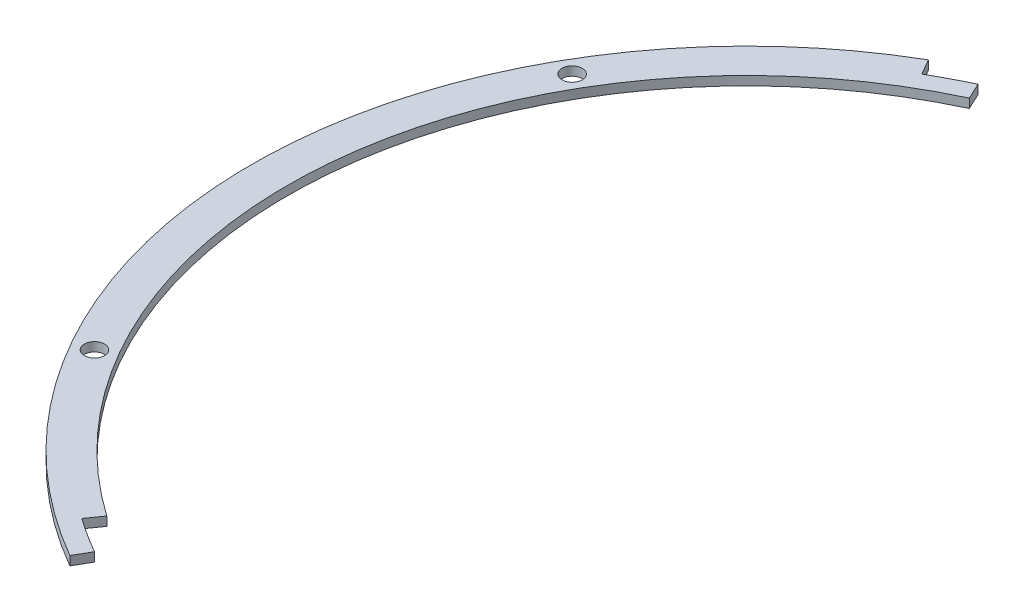
ISO-10303-21;
HEADER;
FILE_DESCRIPTION(('STEP AP214'),'2;1');
FILE_NAME('part.step','',(''),(''),'','','');
FILE_SCHEMA(('AUTOMOTIVE_DESIGN { 1 0 10303 214 1 1 1 1 }'));
ENDSEC;
DATA;
#1=APPLICATION_CONTEXT('core data for automotive mechanical design processes');
#2=APPLICATION_PROTOCOL_DEFINITION('international standard','automotive_design',2000,#1);
#3=PRODUCT_CONTEXT('',#1,'mechanical');
#4=PRODUCT('Part','Part','',(#3));
#5=PRODUCT_RELATED_PRODUCT_CATEGORY('part','',(#4));
#6=PRODUCT_DEFINITION_FORMATION('','',#4);
#7=PRODUCT_DEFINITION_CONTEXT('part definition',#1,'design');
#8=PRODUCT_DEFINITION('design','',#6,#7);
#9=PRODUCT_DEFINITION_SHAPE('','',#8);
#10=(LENGTH_UNIT() NAMED_UNIT(*) SI_UNIT(.MILLI.,.METRE.));
#11=(NAMED_UNIT(*) PLANE_ANGLE_UNIT() SI_UNIT($,.RADIAN.));
#12=(NAMED_UNIT(*) SI_UNIT($,.STERADIAN.) SOLID_ANGLE_UNIT());
#13=UNCERTAINTY_MEASURE_WITH_UNIT(LENGTH_MEASURE(1.E-05),#10,'distance_accuracy_value','');
#14=(GEOMETRIC_REPRESENTATION_CONTEXT(3) GLOBAL_UNCERTAINTY_ASSIGNED_CONTEXT((#13)) GLOBAL_UNIT_ASSIGNED_CONTEXT((#10,
#11,#12)) REPRESENTATION_CONTEXT('',''));
#15=CARTESIAN_POINT('',(0.,0.,0.));
#16=DIRECTION('',(0.,0.,1.));
#17=DIRECTION('',(1.,0.,0.));
#18=AXIS2_PLACEMENT_3D('',#15,#16,#17);
#19=CARTESIAN_POINT('',(0.,3.175,0.));
#20=DIRECTION('',(0.,1.,0.));
#21=DIRECTION('',(0.,0.,1.));
#22=AXIS2_PLACEMENT_3D('',#19,#20,#21);
#23=PLANE('',#22);
#24=CARTESIAN_POINT('',(-145.925280537664,3.175,84.2500000000083));
#25=DIRECTION('',(0.,1.,0.));
#26=DIRECTION('',(0.,0.,1.));
#27=AXIS2_PLACEMENT_3D('',#24,#25,#26);
#28=CIRCLE('',#27,3.55600000000001);
#29=CARTESIAN_POINT('',(-145.925280537664,3.175,87.8060000000084));
#30=VERTEX_POINT('',#29);
#31=EDGE_CURVE('E194',#30,#30,#28,.T.);
#32=ORIENTED_EDGE('',*,*,#31,.F.);
#33=EDGE_LOOP('',(#32));
#34=FACE_BOUND('',#33,.T.);
#35=CARTESIAN_POINT('',(-145.925280537673,3.175,-84.2499999999916));
#36=DIRECTION('',(0.,1.,0.));
#37=DIRECTION('',(0.,0.,1.));
#38=AXIS2_PLACEMENT_3D('',#35,#36,#37);
#39=CIRCLE('',#38,3.55600000000001);
#40=CARTESIAN_POINT('',(-145.925280537673,3.175,-80.6939999999916));
#41=VERTEX_POINT('',#40);
#42=EDGE_CURVE('E186',#41,#41,#39,.T.);
#43=ORIENTED_EDGE('',*,*,#42,.F.);
#44=EDGE_LOOP('',(#43));
#45=FACE_BOUND('',#44,.T.);
#46=CARTESIAN_POINT('',(0.,3.175,0.));
#47=DIRECTION('',(0.,-1.,0.));
#48=DIRECTION('',(0.,0.,1.));
#49=AXIS2_PLACEMENT_3D('',#46,#47,#48);
#50=CIRCLE('',#49,168.5);
#51=CARTESIAN_POINT('',(-84.2499999999999,3.175,-145.925280537678));
#52=VERTEX_POINT('',#51);
#53=CARTESIAN_POINT('',(-71.2111771033099,3.175,-152.712862115675));
#54=VERTEX_POINT('',#53);
#55=EDGE_CURVE('E120',#52,#54,#50,.T.);
#56=ORIENTED_EDGE('',*,*,#55,.F.);
#57=DIRECTION('',(0.499999999999998,0.,0.86602540378444));
#58=VECTOR('',#57,1.);
#59=CARTESIAN_POINT('',(-88.8999999999998,3.175,-153.979316792873));
#60=LINE('',#59,#58);
#61=CARTESIAN_POINT('',(-87.4249999999999,3.175,-151.424541851709));
#62=VERTEX_POINT('',#61);
#63=EDGE_CURVE('E109',#62,#52,#60,.T.);
#64=ORIENTED_EDGE('',*,*,#63,.F.);
#65=CARTESIAN_POINT('',(0.,3.175,0.));
#66=DIRECTION('',(0.,1.,0.));
#67=DIRECTION('',(0.,0.,1.));
#68=AXIS2_PLACEMENT_3D('',#65,#66,#67);
#69=CIRCLE('',#68,174.85);
#70=CARTESIAN_POINT('',(-87.4250000000005,3.175,151.424541851709));
#71=VERTEX_POINT('',#70);
#72=EDGE_CURVE('E202',#62,#71,#69,.T.);
#73=ORIENTED_EDGE('',*,*,#72,.T.);
#74=DIRECTION('',(-0.500000000000002,0.,0.866025403784437));
#75=VECTOR('',#74,1.);
#76=CARTESIAN_POINT('',(-84.2500000000005,3.175,145.925280537678));
#77=LINE('',#76,#75);
#78=CARTESIAN_POINT('',(-84.2500000000005,3.175,145.925280537678));
#79=VERTEX_POINT('',#78);
#80=EDGE_CURVE('E143',#79,#71,#77,.T.);
#81=ORIENTED_EDGE('',*,*,#80,.F.);
#82=CARTESIAN_POINT('',(0.,3.175,0.));
#83=DIRECTION('',(0.,1.,0.));
#84=DIRECTION('',(0.,0.,1.));
#85=AXIS2_PLACEMENT_3D('',#82,#83,#84);
#86=CIRCLE('',#85,168.5);
#87=CARTESIAN_POINT('',(-96.6476295251518,3.175,138.027119462695));
#88=VERTEX_POINT('',#87);
#89=EDGE_CURVE('E140',#88,#79,#86,.T.);
#90=ORIENTED_EDGE('',*,*,#89,.F.);
#91=DIRECTION('',(-0.573576436351051,0.,0.819152044288988));
#92=VECTOR('',#91,1.);
#93=CARTESIAN_POINT('',(-96.6476295251518,3.175,138.027119462695));
#94=LINE('',#93,#92);
#95=CARTESIAN_POINT('',(-93.0054191543226,3.175,132.82550398146));
#96=VERTEX_POINT('',#95);
#97=EDGE_CURVE('E135',#96,#88,#94,.T.);
#98=ORIENTED_EDGE('',*,*,#97,.F.);
#99=CARTESIAN_POINT('',(0.,3.175,0.));
#100=DIRECTION('',(0.,1.,0.));
#101=DIRECTION('',(0.,0.,1.));
#102=AXIS2_PLACEMENT_3D('',#99,#100,#101);
#103=CIRCLE('',#102,162.15);
#104=CARTESIAN_POINT('',(-68.5275511412553,3.175,-146.957807667992));
#105=VERTEX_POINT('',#104);
#106=EDGE_CURVE('E180',#105,#96,#103,.T.);
#107=ORIENTED_EDGE('',*,*,#106,.F.);
#108=DIRECTION('',(0.422618261740886,0.,0.906307787036563));
#109=VECTOR('',#108,1.);
#110=CARTESIAN_POINT('',(-71.2111771033099,3.175,-152.712862115675));
#111=LINE('',#110,#109);
#112=EDGE_CURVE('E66',#54,#105,#111,.T.);
#113=ORIENTED_EDGE('',*,*,#112,.F.);
#114=EDGE_LOOP('',(#56,#64,#73,#81,#90,#98,#107,#113));
#115=FACE_BOUND('',#114,.T.);
#116=ADVANCED_FACE('F42',(#34,#45,#115),#23,.T.);
#117=CARTESIAN_POINT('',(0.,0.,0.));
#118=DIRECTION('',(0.,1.,0.));
#119=DIRECTION('',(0.,0.,1.));
#120=AXIS2_PLACEMENT_3D('',#117,#118,#119);
#121=PLANE('',#120);
#122=CARTESIAN_POINT('',(-145.925280537673,0.,-84.2499999999916));
#123=DIRECTION('',(0.,1.,0.));
#124=DIRECTION('',(0.,0.,1.));
#125=AXIS2_PLACEMENT_3D('',#122,#123,#124);
#126=CIRCLE('',#125,3.55600000000001);
#127=CARTESIAN_POINT('',(-145.925280537673,0.,-80.6939999999916));
#128=VERTEX_POINT('',#127);
#129=EDGE_CURVE('E183',#128,#128,#126,.T.);
#130=ORIENTED_EDGE('',*,*,#129,.T.);
#131=EDGE_LOOP('',(#130));
#132=FACE_BOUND('',#131,.T.);
#133=CARTESIAN_POINT('',(-145.925280537664,0.,84.2500000000083));
#134=DIRECTION('',(0.,1.,0.));
#135=DIRECTION('',(0.,0.,1.));
#136=AXIS2_PLACEMENT_3D('',#133,#134,#135);
#137=CIRCLE('',#136,3.55600000000001);
#138=CARTESIAN_POINT('',(-145.925280537664,0.,87.8060000000084));
#139=VERTEX_POINT('',#138);
#140=EDGE_CURVE('E190',#139,#139,#137,.T.);
#141=ORIENTED_EDGE('',*,*,#140,.T.);
#142=EDGE_LOOP('',(#141));
#143=FACE_BOUND('',#142,.T.);
#144=DIRECTION('',(0.499999999999998,0.,0.86602540378444));
#145=VECTOR('',#144,1.);
#146=CARTESIAN_POINT('',(-88.8999999999998,0.,-153.979316792873));
#147=LINE('',#146,#145);
#148=CARTESIAN_POINT('',(-87.4249999999999,0.,-151.424541851709));
#149=VERTEX_POINT('',#148);
#150=CARTESIAN_POINT('',(-84.2499999999999,0.,-145.925280537678));
#151=VERTEX_POINT('',#150);
#152=EDGE_CURVE('E147',#149,#151,#147,.T.);
#153=ORIENTED_EDGE('',*,*,#152,.T.);
#154=CARTESIAN_POINT('',(0.,0.,0.));
#155=DIRECTION('',(0.,-1.,0.));
#156=DIRECTION('',(0.,0.,1.));
#157=AXIS2_PLACEMENT_3D('',#154,#155,#156);
#158=CIRCLE('',#157,168.5);
#159=CARTESIAN_POINT('',(-71.2111771033099,0.,-152.712862115675));
#160=VERTEX_POINT('',#159);
#161=EDGE_CURVE('E126',#151,#160,#158,.T.);
#162=ORIENTED_EDGE('',*,*,#161,.T.);
#163=DIRECTION('',(0.422618261740886,0.,0.906307787036563));
#164=VECTOR('',#163,1.);
#165=CARTESIAN_POINT('',(-71.2111771033099,0.,-152.712862115675));
#166=LINE('',#165,#164);
#167=CARTESIAN_POINT('',(-68.5275511412553,0.,-146.957807667992));
#168=VERTEX_POINT('',#167);
#169=EDGE_CURVE('E152',#160,#168,#166,.T.);
#170=ORIENTED_EDGE('',*,*,#169,.T.);
#171=CARTESIAN_POINT('',(0.,0.,0.));
#172=DIRECTION('',(0.,1.,0.));
#173=DIRECTION('',(0.,0.,1.));
#174=AXIS2_PLACEMENT_3D('',#171,#172,#173);
#175=CIRCLE('',#174,162.15);
#176=CARTESIAN_POINT('',(-93.0054191543226,0.,132.82550398146));
#177=VERTEX_POINT('',#176);
#178=EDGE_CURVE('E58',#168,#177,#175,.T.);
#179=ORIENTED_EDGE('',*,*,#178,.T.);
#180=DIRECTION('',(-0.573576436351051,0.,0.819152044288988));
#181=VECTOR('',#180,1.);
#182=CARTESIAN_POINT('',(-96.6476295251518,0.,138.027119462695));
#183=LINE('',#182,#181);
#184=CARTESIAN_POINT('',(-96.6476295251518,0.,138.027119462695));
#185=VERTEX_POINT('',#184);
#186=EDGE_CURVE('E155',#177,#185,#183,.T.);
#187=ORIENTED_EDGE('',*,*,#186,.T.);
#188=CARTESIAN_POINT('',(0.,0.,0.));
#189=DIRECTION('',(0.,1.,0.));
#190=DIRECTION('',(0.,0.,1.));
#191=AXIS2_PLACEMENT_3D('',#188,#189,#190);
#192=CIRCLE('',#191,168.5);
#193=CARTESIAN_POINT('',(-84.2500000000005,0.,145.925280537678));
#194=VERTEX_POINT('',#193);
#195=EDGE_CURVE('E158',#185,#194,#192,.T.);
#196=ORIENTED_EDGE('',*,*,#195,.T.);
#197=DIRECTION('',(-0.500000000000008,0.,0.866025403784434));
#198=VECTOR('',#197,1.);
#199=CARTESIAN_POINT('',(-87.4250000000005,0.,151.424541851709));
#200=LINE('',#199,#198);
#201=CARTESIAN_POINT('',(-87.4250000000005,0.,151.424541851709));
#202=VERTEX_POINT('',#201);
#203=EDGE_CURVE('E121',#194,#202,#200,.T.);
#204=ORIENTED_EDGE('',*,*,#203,.T.);
#205=CARTESIAN_POINT('',(0.,0.,0.));
#206=DIRECTION('',(0.,1.,0.));
#207=DIRECTION('',(0.,0.,1.));
#208=AXIS2_PLACEMENT_3D('',#205,#206,#207);
#209=CIRCLE('',#208,174.85);
#210=EDGE_CURVE('E198',#149,#202,#209,.T.);
#211=ORIENTED_EDGE('',*,*,#210,.F.);
#212=EDGE_LOOP('',(#153,#162,#170,#179,#187,#196,#204,#211));
#213=FACE_BOUND('',#212,.T.);
#214=ADVANCED_FACE('F215',(#132,#143,#213),#121,.F.);
#215=CARTESIAN_POINT('',(0.,3.175,0.));
#216=DIRECTION('',(0.,-1.,0.));
#217=DIRECTION('',(0.,0.,-1.));
#218=AXIS2_PLACEMENT_3D('',#215,#216,#217);
#219=CYLINDRICAL_SURFACE('',#218,174.85);
#220=DIRECTION('',(0.,-1.,0.));
#221=VECTOR('',#220,1.);
#222=CARTESIAN_POINT('',(-87.4249999999998,3.175,-151.424541851709));
#223=LINE('',#222,#221);
#224=EDGE_CURVE('E11',#149,#62,#223,.F.);
#225=ORIENTED_EDGE('',*,*,#224,.F.);
#226=ORIENTED_EDGE('',*,*,#210,.T.);
#227=DIRECTION('',(0.,-1.,0.));
#228=VECTOR('',#227,1.);
#229=CARTESIAN_POINT('',(-87.4250000000005,3.175,151.424541851709));
#230=LINE('',#229,#228);
#231=EDGE_CURVE('E51',#71,#202,#230,.T.);
#232=ORIENTED_EDGE('',*,*,#231,.F.);
#233=ORIENTED_EDGE('',*,*,#72,.F.);
#234=EDGE_LOOP('',(#225,#226,#232,#233));
#235=FACE_BOUND('',#234,.T.);
#236=ADVANCED_FACE('F44',(#235),#219,.T.);
#237=CARTESIAN_POINT('',(0.,3.175,0.));
#238=DIRECTION('',(0.,-1.,0.));
#239=DIRECTION('',(0.,0.,-1.));
#240=AXIS2_PLACEMENT_3D('',#237,#238,#239);
#241=CYLINDRICAL_SURFACE('',#240,162.15);
#242=DIRECTION('',(0.,-1.,0.));
#243=VECTOR('',#242,1.);
#244=CARTESIAN_POINT('',(-93.0054191543226,3.175,132.82550398146));
#245=LINE('',#244,#243);
#246=EDGE_CURVE('E171',#96,#177,#245,.T.);
#247=ORIENTED_EDGE('',*,*,#246,.T.);
#248=ORIENTED_EDGE('',*,*,#178,.F.);
#249=DIRECTION('',(0.,-1.,0.));
#250=VECTOR('',#249,1.);
#251=CARTESIAN_POINT('',(-68.5275511412553,3.175,-146.957807667992));
#252=LINE('',#251,#250);
#253=EDGE_CURVE('E175',#105,#168,#252,.T.);
#254=ORIENTED_EDGE('',*,*,#253,.F.);
#255=ORIENTED_EDGE('',*,*,#106,.T.);
#256=EDGE_LOOP('',(#247,#248,#254,#255));
#257=FACE_BOUND('',#256,.T.);
#258=ADVANCED_FACE('F226',(#257),#241,.F.);
#259=CARTESIAN_POINT('',(-145.925280537664,3.175,84.2500000000083));
#260=DIRECTION('',(0.,-1.,0.));
#261=DIRECTION('',(0.,0.,-1.));
#262=AXIS2_PLACEMENT_3D('',#259,#260,#261);
#263=CYLINDRICAL_SURFACE('',#262,3.55600000000001);
#264=ORIENTED_EDGE('',*,*,#31,.T.);
#265=EDGE_LOOP('',(#264));
#266=FACE_BOUND('',#265,.T.);
#267=ORIENTED_EDGE('',*,*,#140,.F.);
#268=EDGE_LOOP('',(#267));
#269=FACE_BOUND('',#268,.T.);
#270=ADVANCED_FACE('F246',(#266,#269),#263,.F.);
#271=CARTESIAN_POINT('',(-145.925280537673,3.175,-84.2499999999916));
#272=DIRECTION('',(0.,-1.,0.));
#273=DIRECTION('',(0.,0.,-1.));
#274=AXIS2_PLACEMENT_3D('',#271,#272,#273);
#275=CYLINDRICAL_SURFACE('',#274,3.55600000000001);
#276=ORIENTED_EDGE('',*,*,#42,.T.);
#277=EDGE_LOOP('',(#276));
#278=FACE_BOUND('',#277,.T.);
#279=ORIENTED_EDGE('',*,*,#129,.F.);
#280=EDGE_LOOP('',(#279));
#281=FACE_BOUND('',#280,.T.);
#282=ADVANCED_FACE('F249',(#278,#281),#275,.F.);
#283=CARTESIAN_POINT('',(-96.6476295251518,3.175,138.027119462695));
#284=DIRECTION('',(0.819152044288988,0.,0.573576436351051));
#285=DIRECTION('',(0.573576436351051,0.,-0.819152044288988));
#286=AXIS2_PLACEMENT_3D('',#283,#284,#285);
#287=PLANE('',#286);
#288=ORIENTED_EDGE('',*,*,#186,.F.);
#289=ORIENTED_EDGE('',*,*,#246,.F.);
#290=ORIENTED_EDGE('',*,*,#97,.T.);
#291=DIRECTION('',(0.,-1.,0.));
#292=VECTOR('',#291,1.);
#293=CARTESIAN_POINT('',(-96.6476295251518,3.175,138.027119462695));
#294=LINE('',#293,#292);
#295=EDGE_CURVE('E168',#88,#185,#294,.T.);
#296=ORIENTED_EDGE('',*,*,#295,.T.);
#297=EDGE_LOOP('',(#288,#289,#290,#296));
#298=FACE_BOUND('',#297,.T.);
#299=ADVANCED_FACE('F223',(#298),#287,.T.);
#300=CARTESIAN_POINT('',(-87.4250000000005,3.175,151.424541851709));
#301=DIRECTION('',(0.866025403784434,0.,0.500000000000008));
#302=DIRECTION('',(0.500000000000008,0.,-0.866025403784434));
#303=AXIS2_PLACEMENT_3D('',#300,#301,#302);
#304=PLANE('',#303);
#305=ORIENTED_EDGE('',*,*,#231,.T.);
#306=ORIENTED_EDGE('',*,*,#203,.F.);
#307=DIRECTION('',(0.,-1.,0.));
#308=VECTOR('',#307,1.);
#309=CARTESIAN_POINT('',(-84.2500000000005,3.175,145.925280537678));
#310=LINE('',#309,#308);
#311=EDGE_CURVE('E146',#79,#194,#310,.T.);
#312=ORIENTED_EDGE('',*,*,#311,.F.);
#313=ORIENTED_EDGE('',*,*,#80,.T.);
#314=EDGE_LOOP('',(#305,#306,#312,#313));
#315=FACE_BOUND('',#314,.T.);
#316=ADVANCED_FACE('F210',(#315),#304,.T.);
#317=CARTESIAN_POINT('',(0.,3.175,0.));
#318=DIRECTION('',(0.,-1.,0.));
#319=DIRECTION('',(0.,0.,-1.));
#320=AXIS2_PLACEMENT_3D('',#317,#318,#319);
#321=CYLINDRICAL_SURFACE('',#320,168.5);
#322=ORIENTED_EDGE('',*,*,#195,.F.);
#323=ORIENTED_EDGE('',*,*,#295,.F.);
#324=ORIENTED_EDGE('',*,*,#89,.T.);
#325=ORIENTED_EDGE('',*,*,#311,.T.);
#326=EDGE_LOOP('',(#322,#323,#324,#325));
#327=FACE_BOUND('',#326,.T.);
#328=ADVANCED_FACE('F221',(#327),#321,.F.);
#329=CARTESIAN_POINT('',(-88.8999999999998,3.175,-153.979316792873));
#330=DIRECTION('',(0.86602540378444,0.,-0.499999999999997));
#331=DIRECTION('',(-0.499999999999998,0.,-0.86602540378444));
#332=AXIS2_PLACEMENT_3D('',#329,#330,#331);
#333=PLANE('',#332);
#334=ORIENTED_EDGE('',*,*,#224,.T.);
#335=ORIENTED_EDGE('',*,*,#63,.T.);
#336=DIRECTION('',(0.,-1.,0.));
#337=VECTOR('',#336,1.);
#338=CARTESIAN_POINT('',(-84.2499999999999,3.175,-145.925280537678));
#339=LINE('',#338,#337);
#340=EDGE_CURVE('E112',#52,#151,#339,.T.);
#341=ORIENTED_EDGE('',*,*,#340,.T.);
#342=ORIENTED_EDGE('',*,*,#152,.F.);
#343=EDGE_LOOP('',(#334,#335,#341,#342));
#344=FACE_BOUND('',#343,.T.);
#345=ADVANCED_FACE('F111',(#344),#333,.T.);
#346=CARTESIAN_POINT('',(0.,3.175,0.));
#347=DIRECTION('',(0.,-1.,0.));
#348=DIRECTION('',(0.,0.,-1.));
#349=AXIS2_PLACEMENT_3D('',#346,#347,#348);
#350=CYLINDRICAL_SURFACE('',#349,168.5);
#351=ORIENTED_EDGE('',*,*,#161,.F.);
#352=ORIENTED_EDGE('',*,*,#340,.F.);
#353=ORIENTED_EDGE('',*,*,#55,.T.);
#354=DIRECTION('',(0.,-1.,0.));
#355=VECTOR('',#354,1.);
#356=CARTESIAN_POINT('',(-71.2111771033099,3.175,-152.712862115675));
#357=LINE('',#356,#355);
#358=EDGE_CURVE('E129',#54,#160,#357,.T.);
#359=ORIENTED_EDGE('',*,*,#358,.T.);
#360=EDGE_LOOP('',(#351,#352,#353,#359));
#361=FACE_BOUND('',#360,.T.);
#362=ADVANCED_FACE('F124',(#361),#350,.T.);
#363=CARTESIAN_POINT('',(-71.2111771033099,3.175,-152.712862115675));
#364=DIRECTION('',(0.906307787036563,0.,-0.422618261740886));
#365=DIRECTION('',(-0.422618261740886,0.,-0.906307787036563));
#366=AXIS2_PLACEMENT_3D('',#363,#364,#365);
#367=PLANE('',#366);
#368=ORIENTED_EDGE('',*,*,#169,.F.);
#369=ORIENTED_EDGE('',*,*,#358,.F.);
#370=ORIENTED_EDGE('',*,*,#112,.T.);
#371=ORIENTED_EDGE('',*,*,#253,.T.);
#372=EDGE_LOOP('',(#368,#369,#370,#371));
#373=FACE_BOUND('',#372,.T.);
#374=ADVANCED_FACE('F228',(#373),#367,.T.);
#375=CLOSED_SHELL('',(#116,#214,#236,#258,#270,#282,#299,#316,#328,#345,#362,#374));
#376=MANIFOLD_SOLID_BREP('B2',#375);
#377=ADVANCED_BREP_SHAPE_REPRESENTATION('',(#18,#376),#14);
#378=SHAPE_DEFINITION_REPRESENTATION(#9,#377);
ENDSEC;
END-ISO-10303-21;
